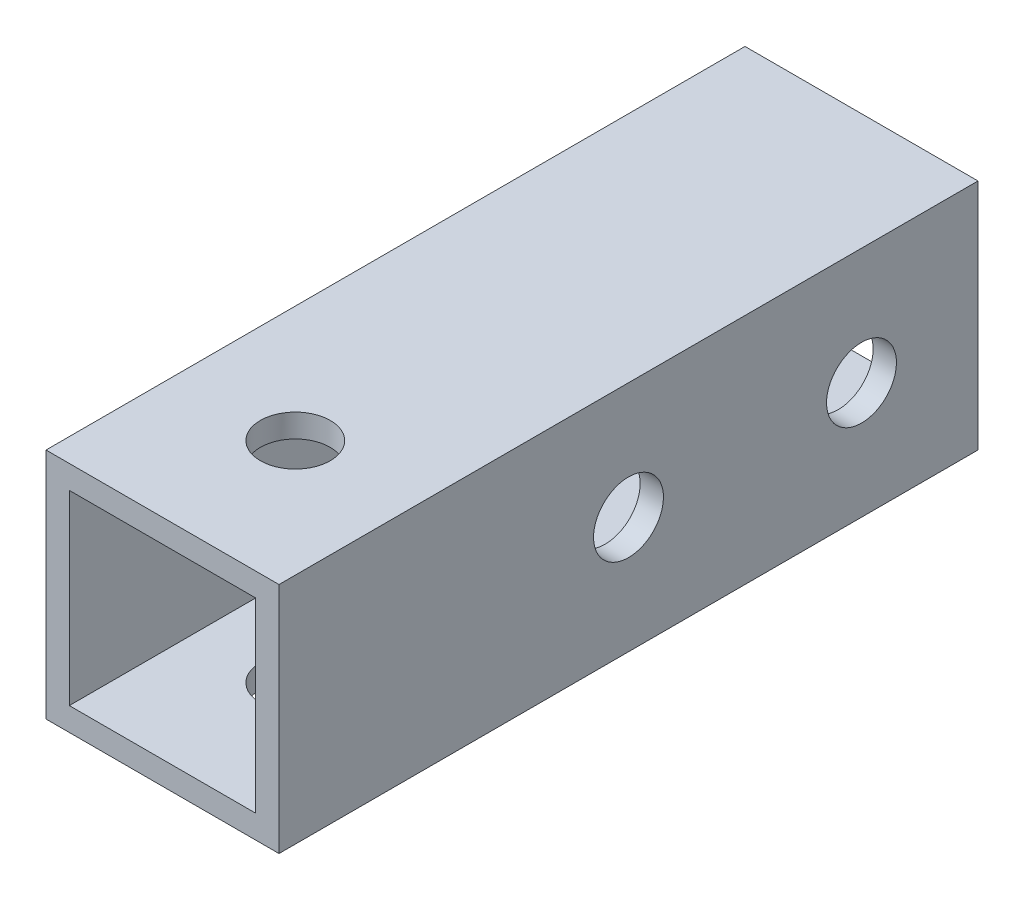
ISO-10303-21;
HEADER;
FILE_DESCRIPTION(('STEP AP214'),'2;1');
FILE_NAME('part.step','',(''),(''),'','','');
FILE_SCHEMA(('AUTOMOTIVE_DESIGN { 1 0 10303 214 1 1 1 1 }'));
ENDSEC;
DATA;
#1=APPLICATION_CONTEXT('core data for automotive mechanical design processes');
#2=APPLICATION_PROTOCOL_DEFINITION('international standard','automotive_design',2000,#1);
#3=PRODUCT_CONTEXT('',#1,'mechanical');
#4=PRODUCT('Part','Part','',(#3));
#5=PRODUCT_RELATED_PRODUCT_CATEGORY('part','',(#4));
#6=PRODUCT_DEFINITION_FORMATION('','',#4);
#7=PRODUCT_DEFINITION_CONTEXT('part definition',#1,'design');
#8=PRODUCT_DEFINITION('design','',#6,#7);
#9=PRODUCT_DEFINITION_SHAPE('','',#8);
#10=(LENGTH_UNIT() NAMED_UNIT(*) SI_UNIT(.MILLI.,.METRE.));
#11=(NAMED_UNIT(*) PLANE_ANGLE_UNIT() SI_UNIT($,.RADIAN.));
#12=(NAMED_UNIT(*) SI_UNIT($,.STERADIAN.) SOLID_ANGLE_UNIT());
#13=UNCERTAINTY_MEASURE_WITH_UNIT(LENGTH_MEASURE(1.E-05),#10,'distance_accuracy_value','');
#14=(GEOMETRIC_REPRESENTATION_CONTEXT(3) GLOBAL_UNCERTAINTY_ASSIGNED_CONTEXT((#13)) GLOBAL_UNIT_ASSIGNED_CONTEXT((#10,
#11,#12)) REPRESENTATION_CONTEXT('',''));
#15=CARTESIAN_POINT('',(0.,0.,0.));
#16=DIRECTION('',(0.,0.,1.));
#17=DIRECTION('',(1.,0.,0.));
#18=AXIS2_PLACEMENT_3D('',#15,#16,#17);
#19=CARTESIAN_POINT('',(0.,0.,30.));
#20=DIRECTION('',(0.,0.,1.));
#21=DIRECTION('',(1.,0.,0.));
#22=AXIS2_PLACEMENT_3D('',#19,#20,#21);
#23=PLANE('',#22);
#24=DIRECTION('',(0.,-1.,0.));
#25=VECTOR('',#24,1.);
#26=CARTESIAN_POINT('',(-5.,5.,30.));
#27=LINE('',#26,#25);
#28=CARTESIAN_POINT('',(-5.,5.,30.));
#29=VERTEX_POINT('',#28);
#30=CARTESIAN_POINT('',(-5.,-5.,30.));
#31=VERTEX_POINT('',#30);
#32=EDGE_CURVE('E167',#29,#31,#27,.T.);
#33=ORIENTED_EDGE('',*,*,#32,.T.);
#34=DIRECTION('',(1.,0.,0.));
#35=VECTOR('',#34,1.);
#36=CARTESIAN_POINT('',(-5.,-5.,30.));
#37=LINE('',#36,#35);
#38=CARTESIAN_POINT('',(5.,-5.,30.));
#39=VERTEX_POINT('',#38);
#40=EDGE_CURVE('E170',#31,#39,#37,.T.);
#41=ORIENTED_EDGE('',*,*,#40,.T.);
#42=DIRECTION('',(0.,1.,0.));
#43=VECTOR('',#42,1.);
#44=CARTESIAN_POINT('',(5.,5.,30.));
#45=LINE('',#44,#43);
#46=CARTESIAN_POINT('',(5.,5.,30.));
#47=VERTEX_POINT('',#46);
#48=EDGE_CURVE('E173',#39,#47,#45,.T.);
#49=ORIENTED_EDGE('',*,*,#48,.T.);
#50=DIRECTION('',(-1.,0.,0.));
#51=VECTOR('',#50,1.);
#52=CARTESIAN_POINT('',(-5.,5.,30.));
#53=LINE('',#52,#51);
#54=EDGE_CURVE('E175',#47,#29,#53,.T.);
#55=ORIENTED_EDGE('',*,*,#54,.T.);
#56=EDGE_LOOP('',(#33,#41,#49,#55));
#57=FACE_BOUND('',#56,.T.);
#58=DIRECTION('',(1.,0.,0.));
#59=VECTOR('',#58,1.);
#60=CARTESIAN_POINT('',(-5.,-4.,30.));
#61=LINE('',#60,#59);
#62=CARTESIAN_POINT('',(-4.,-4.,30.));
#63=VERTEX_POINT('',#62);
#64=CARTESIAN_POINT('',(4.,-4.,30.));
#65=VERTEX_POINT('',#64);
#66=EDGE_CURVE('E137',#63,#65,#61,.T.);
#67=ORIENTED_EDGE('',*,*,#66,.F.);
#68=DIRECTION('',(0.,-1.,0.));
#69=VECTOR('',#68,1.);
#70=CARTESIAN_POINT('',(-4.,5.,30.));
#71=LINE('',#70,#69);
#72=CARTESIAN_POINT('',(-4.,4.,30.));
#73=VERTEX_POINT('',#72);
#74=EDGE_CURVE('E129',#73,#63,#71,.T.);
#75=ORIENTED_EDGE('',*,*,#74,.F.);
#76=DIRECTION('',(-1.,0.,0.));
#77=VECTOR('',#76,1.);
#78=CARTESIAN_POINT('',(-5.,4.,30.));
#79=LINE('',#78,#77);
#80=CARTESIAN_POINT('',(4.,4.,30.));
#81=VERTEX_POINT('',#80);
#82=EDGE_CURVE('E151',#81,#73,#79,.T.);
#83=ORIENTED_EDGE('',*,*,#82,.F.);
#84=DIRECTION('',(0.,1.,0.));
#85=VECTOR('',#84,1.);
#86=CARTESIAN_POINT('',(4.,5.,30.));
#87=LINE('',#86,#85);
#88=EDGE_CURVE('E149',#65,#81,#87,.T.);
#89=ORIENTED_EDGE('',*,*,#88,.F.);
#90=EDGE_LOOP('',(#67,#75,#83,#89));
#91=FACE_BOUND('',#90,.T.);
#92=ADVANCED_FACE('F62',(#57,#91),#23,.T.);
#93=CARTESIAN_POINT('',(0.,0.,0.));
#94=DIRECTION('',(0.,0.,1.));
#95=DIRECTION('',(1.,0.,0.));
#96=AXIS2_PLACEMENT_3D('',#93,#94,#95);
#97=PLANE('',#96);
#98=DIRECTION('',(0.,-1.,0.));
#99=VECTOR('',#98,1.);
#100=CARTESIAN_POINT('',(-5.,5.,0.));
#101=LINE('',#100,#99);
#102=CARTESIAN_POINT('',(-5.,5.,0.));
#103=VERTEX_POINT('',#102);
#104=CARTESIAN_POINT('',(-5.,-5.,0.));
#105=VERTEX_POINT('',#104);
#106=EDGE_CURVE('E145',#103,#105,#101,.T.);
#107=ORIENTED_EDGE('',*,*,#106,.F.);
#108=DIRECTION('',(-1.,0.,0.));
#109=VECTOR('',#108,1.);
#110=CARTESIAN_POINT('',(-5.,5.,0.));
#111=LINE('',#110,#109);
#112=CARTESIAN_POINT('',(5.,5.,0.));
#113=VERTEX_POINT('',#112);
#114=EDGE_CURVE('E171',#113,#103,#111,.T.);
#115=ORIENTED_EDGE('',*,*,#114,.F.);
#116=DIRECTION('',(0.,1.,0.));
#117=VECTOR('',#116,1.);
#118=CARTESIAN_POINT('',(5.,5.,0.));
#119=LINE('',#118,#117);
#120=CARTESIAN_POINT('',(5.,-5.,0.));
#121=VERTEX_POINT('',#120);
#122=EDGE_CURVE('E182',#121,#113,#119,.T.);
#123=ORIENTED_EDGE('',*,*,#122,.F.);
#124=DIRECTION('',(1.,0.,0.));
#125=VECTOR('',#124,1.);
#126=CARTESIAN_POINT('',(-5.,-5.,0.));
#127=LINE('',#126,#125);
#128=EDGE_CURVE('E180',#105,#121,#127,.T.);
#129=ORIENTED_EDGE('',*,*,#128,.F.);
#130=EDGE_LOOP('',(#107,#115,#123,#129));
#131=FACE_BOUND('',#130,.T.);
#132=DIRECTION('',(0.,-1.,0.));
#133=VECTOR('',#132,1.);
#134=CARTESIAN_POINT('',(-4.,5.,0.));
#135=LINE('',#134,#133);
#136=CARTESIAN_POINT('',(-4.,4.,0.));
#137=VERTEX_POINT('',#136);
#138=CARTESIAN_POINT('',(-4.,-4.,0.));
#139=VERTEX_POINT('',#138);
#140=EDGE_CURVE('E87',#137,#139,#135,.T.);
#141=ORIENTED_EDGE('',*,*,#140,.T.);
#142=DIRECTION('',(1.,0.,0.));
#143=VECTOR('',#142,1.);
#144=CARTESIAN_POINT('',(-5.,-4.,0.));
#145=LINE('',#144,#143);
#146=CARTESIAN_POINT('',(4.,-4.,0.));
#147=VERTEX_POINT('',#146);
#148=EDGE_CURVE('E144',#139,#147,#145,.T.);
#149=ORIENTED_EDGE('',*,*,#148,.T.);
#150=DIRECTION('',(0.,1.,0.));
#151=VECTOR('',#150,1.);
#152=CARTESIAN_POINT('',(4.,5.,0.));
#153=LINE('',#152,#151);
#154=CARTESIAN_POINT('',(4.,4.,0.));
#155=VERTEX_POINT('',#154);
#156=EDGE_CURVE('E159',#147,#155,#153,.T.);
#157=ORIENTED_EDGE('',*,*,#156,.T.);
#158=DIRECTION('',(-1.,0.,0.));
#159=VECTOR('',#158,1.);
#160=CARTESIAN_POINT('',(-5.,4.,0.));
#161=LINE('',#160,#159);
#162=EDGE_CURVE('E138',#155,#137,#161,.T.);
#163=ORIENTED_EDGE('',*,*,#162,.T.);
#164=EDGE_LOOP('',(#141,#149,#157,#163));
#165=FACE_BOUND('',#164,.T.);
#166=ADVANCED_FACE('F240',(#131,#165),#97,.F.);
#167=CARTESIAN_POINT('',(-5.,5.,30.));
#168=DIRECTION('',(1.,0.,0.));
#169=DIRECTION('',(0.,1.,0.));
#170=AXIS2_PLACEMENT_3D('',#167,#168,#169);
#171=PLANE('',#170);
#172=CARTESIAN_POINT('',(-5.00000000000001,0.,5.));
#173=DIRECTION('',(1.,0.,0.));
#174=DIRECTION('',(0.,1.,0.));
#175=AXIS2_PLACEMENT_3D('',#172,#173,#174);
#176=CIRCLE('',#175,1.5);
#177=CARTESIAN_POINT('',(-5.00000000000001,1.49999999999999,5.));
#178=VERTEX_POINT('',#177);
#179=EDGE_CURVE('E195',#178,#178,#176,.T.);
#180=ORIENTED_EDGE('',*,*,#179,.T.);
#181=EDGE_LOOP('',(#180));
#182=FACE_BOUND('',#181,.T.);
#183=CARTESIAN_POINT('',(-5.00000000000001,0.,15.));
#184=DIRECTION('',(1.,0.,0.));
#185=DIRECTION('',(0.,1.,0.));
#186=AXIS2_PLACEMENT_3D('',#183,#184,#185);
#187=CIRCLE('',#186,1.5);
#188=CARTESIAN_POINT('',(-5.00000000000001,1.49999999999999,15.));
#189=VERTEX_POINT('',#188);
#190=EDGE_CURVE('E209',#189,#189,#187,.T.);
#191=ORIENTED_EDGE('',*,*,#190,.T.);
#192=EDGE_LOOP('',(#191));
#193=FACE_BOUND('',#192,.T.);
#194=ORIENTED_EDGE('',*,*,#106,.T.);
#195=DIRECTION('',(0.,0.,-1.));
#196=VECTOR('',#195,1.);
#197=CARTESIAN_POINT('',(-5.,-5.,30.));
#198=LINE('',#197,#196);
#199=EDGE_CURVE('E12',#31,#105,#198,.T.);
#200=ORIENTED_EDGE('',*,*,#199,.F.);
#201=ORIENTED_EDGE('',*,*,#32,.F.);
#202=DIRECTION('',(0.,0.,-1.));
#203=VECTOR('',#202,1.);
#204=CARTESIAN_POINT('',(-5.,5.,30.));
#205=LINE('',#204,#203);
#206=EDGE_CURVE('E177',#29,#103,#205,.T.);
#207=ORIENTED_EDGE('',*,*,#206,.T.);
#208=EDGE_LOOP('',(#194,#200,#201,#207));
#209=FACE_BOUND('',#208,.T.);
#210=ADVANCED_FACE('F64',(#182,#193,#209),#171,.F.);
#211=CARTESIAN_POINT('',(-5.,-5.,30.));
#212=DIRECTION('',(0.,1.,0.));
#213=DIRECTION('',(0.,0.,1.));
#214=AXIS2_PLACEMENT_3D('',#211,#212,#213);
#215=PLANE('',#214);
#216=CARTESIAN_POINT('',(0.,-5.,24.3));
#217=DIRECTION('',(0.,1.,0.));
#218=DIRECTION('',(0.,0.,1.));
#219=AXIS2_PLACEMENT_3D('',#216,#217,#218);
#220=CIRCLE('',#219,1.5);
#221=CARTESIAN_POINT('',(0.,-5.,25.8));
#222=VERTEX_POINT('',#221);
#223=EDGE_CURVE('E223',#222,#222,#220,.T.);
#224=ORIENTED_EDGE('',*,*,#223,.T.);
#225=EDGE_LOOP('',(#224));
#226=FACE_BOUND('',#225,.T.);
#227=ORIENTED_EDGE('',*,*,#128,.T.);
#228=DIRECTION('',(0.,0.,-1.));
#229=VECTOR('',#228,1.);
#230=CARTESIAN_POINT('',(5.,-5.,30.));
#231=LINE('',#230,#229);
#232=EDGE_CURVE('E71',#39,#121,#231,.T.);
#233=ORIENTED_EDGE('',*,*,#232,.F.);
#234=ORIENTED_EDGE('',*,*,#40,.F.);
#235=ORIENTED_EDGE('',*,*,#199,.T.);
#236=EDGE_LOOP('',(#227,#233,#234,#235));
#237=FACE_BOUND('',#236,.T.);
#238=ADVANCED_FACE('F267',(#226,#237),#215,.F.);
#239=CARTESIAN_POINT('',(5.,5.,30.));
#240=DIRECTION('',(-1.,0.,0.));
#241=DIRECTION('',(0.,-1.,0.));
#242=AXIS2_PLACEMENT_3D('',#239,#240,#241);
#243=PLANE('',#242);
#244=CARTESIAN_POINT('',(5.,0.,5.));
#245=DIRECTION('',(1.,0.,0.));
#246=DIRECTION('',(0.,1.,0.));
#247=AXIS2_PLACEMENT_3D('',#244,#245,#246);
#248=CIRCLE('',#247,1.5);
#249=CARTESIAN_POINT('',(5.,1.5,5.));
#250=VERTEX_POINT('',#249);
#251=EDGE_CURVE('E213',#250,#250,#248,.T.);
#252=ORIENTED_EDGE('',*,*,#251,.F.);
#253=EDGE_LOOP('',(#252));
#254=FACE_BOUND('',#253,.T.);
#255=CARTESIAN_POINT('',(5.,0.,15.));
#256=DIRECTION('',(1.,0.,0.));
#257=DIRECTION('',(0.,1.,0.));
#258=AXIS2_PLACEMENT_3D('',#255,#256,#257);
#259=CIRCLE('',#258,1.5);
#260=CARTESIAN_POINT('',(5.,1.5,15.));
#261=VERTEX_POINT('',#260);
#262=EDGE_CURVE('E206',#261,#261,#259,.T.);
#263=ORIENTED_EDGE('',*,*,#262,.F.);
#264=EDGE_LOOP('',(#263));
#265=FACE_BOUND('',#264,.T.);
#266=ORIENTED_EDGE('',*,*,#122,.T.);
#267=DIRECTION('',(0.,0.,-1.));
#268=VECTOR('',#267,1.);
#269=CARTESIAN_POINT('',(5.,5.,30.));
#270=LINE('',#269,#268);
#271=EDGE_CURVE('E187',#47,#113,#270,.T.);
#272=ORIENTED_EDGE('',*,*,#271,.F.);
#273=ORIENTED_EDGE('',*,*,#48,.F.);
#274=ORIENTED_EDGE('',*,*,#232,.T.);
#275=EDGE_LOOP('',(#266,#272,#273,#274));
#276=FACE_BOUND('',#275,.T.);
#277=ADVANCED_FACE('F264',(#254,#265,#276),#243,.F.);
#278=CARTESIAN_POINT('',(-5.,5.,30.));
#279=DIRECTION('',(0.,-1.,0.));
#280=DIRECTION('',(0.,0.,-1.));
#281=AXIS2_PLACEMENT_3D('',#278,#279,#280);
#282=PLANE('',#281);
#283=CARTESIAN_POINT('',(0.,5.,24.3));
#284=DIRECTION('',(0.,1.,0.));
#285=DIRECTION('',(0.,0.,1.));
#286=AXIS2_PLACEMENT_3D('',#283,#284,#285);
#287=CIRCLE('',#286,1.5);
#288=CARTESIAN_POINT('',(0.,5.,25.8));
#289=VERTEX_POINT('',#288);
#290=EDGE_CURVE('E220',#289,#289,#287,.T.);
#291=ORIENTED_EDGE('',*,*,#290,.F.);
#292=EDGE_LOOP('',(#291));
#293=FACE_BOUND('',#292,.T.);
#294=ORIENTED_EDGE('',*,*,#114,.T.);
#295=ORIENTED_EDGE('',*,*,#206,.F.);
#296=ORIENTED_EDGE('',*,*,#54,.F.);
#297=ORIENTED_EDGE('',*,*,#271,.T.);
#298=EDGE_LOOP('',(#294,#295,#296,#297));
#299=FACE_BOUND('',#298,.T.);
#300=ADVANCED_FACE('F261',(#293,#299),#282,.F.);
#301=CARTESIAN_POINT('',(-4.,5.,30.));
#302=DIRECTION('',(1.,0.,0.));
#303=DIRECTION('',(0.,1.,0.));
#304=AXIS2_PLACEMENT_3D('',#301,#302,#303);
#305=PLANE('',#304);
#306=CARTESIAN_POINT('',(-4.,0.,5.));
#307=DIRECTION('',(1.,0.,0.));
#308=DIRECTION('',(0.,1.,0.));
#309=AXIS2_PLACEMENT_3D('',#306,#307,#308);
#310=CIRCLE('',#309,1.5);
#311=CARTESIAN_POINT('',(-4.,1.49999999999999,5.));
#312=VERTEX_POINT('',#311);
#313=EDGE_CURVE('E157',#312,#312,#310,.T.);
#314=ORIENTED_EDGE('',*,*,#313,.F.);
#315=EDGE_LOOP('',(#314));
#316=FACE_BOUND('',#315,.T.);
#317=CARTESIAN_POINT('',(-4.,0.,15.));
#318=DIRECTION('',(1.,0.,0.));
#319=DIRECTION('',(0.,1.,0.));
#320=AXIS2_PLACEMENT_3D('',#317,#318,#319);
#321=CIRCLE('',#320,1.5);
#322=CARTESIAN_POINT('',(-4.,1.5,15.));
#323=VERTEX_POINT('',#322);
#324=EDGE_CURVE('E194',#323,#323,#321,.T.);
#325=ORIENTED_EDGE('',*,*,#324,.F.);
#326=EDGE_LOOP('',(#325));
#327=FACE_BOUND('',#326,.T.);
#328=ORIENTED_EDGE('',*,*,#140,.F.);
#329=DIRECTION('',(0.,0.,-1.));
#330=VECTOR('',#329,1.);
#331=CARTESIAN_POINT('',(-4.,4.,30.));
#332=LINE('',#331,#330);
#333=EDGE_CURVE('E133',#73,#137,#332,.T.);
#334=ORIENTED_EDGE('',*,*,#333,.F.);
#335=ORIENTED_EDGE('',*,*,#74,.T.);
#336=DIRECTION('',(0.,0.,-1.));
#337=VECTOR('',#336,1.);
#338=CARTESIAN_POINT('',(-4.,-4.,30.));
#339=LINE('',#338,#337);
#340=EDGE_CURVE('E132',#63,#139,#339,.T.);
#341=ORIENTED_EDGE('',*,*,#340,.T.);
#342=EDGE_LOOP('',(#328,#334,#335,#341));
#343=FACE_BOUND('',#342,.T.);
#344=ADVANCED_FACE('F131',(#316,#327,#343),#305,.T.);
#345=CARTESIAN_POINT('',(-5.,-4.,30.));
#346=DIRECTION('',(0.,1.,0.));
#347=DIRECTION('',(0.,0.,1.));
#348=AXIS2_PLACEMENT_3D('',#345,#346,#347);
#349=PLANE('',#348);
#350=CARTESIAN_POINT('',(0.,-4.,24.3));
#351=DIRECTION('',(0.,1.,0.));
#352=DIRECTION('',(0.,0.,1.));
#353=AXIS2_PLACEMENT_3D('',#350,#351,#352);
#354=CIRCLE('',#353,1.5);
#355=CARTESIAN_POINT('',(0.,-4.,25.8));
#356=VERTEX_POINT('',#355);
#357=EDGE_CURVE('E210',#356,#356,#354,.T.);
#358=ORIENTED_EDGE('',*,*,#357,.F.);
#359=EDGE_LOOP('',(#358));
#360=FACE_BOUND('',#359,.T.);
#361=ORIENTED_EDGE('',*,*,#148,.F.);
#362=ORIENTED_EDGE('',*,*,#340,.F.);
#363=ORIENTED_EDGE('',*,*,#66,.T.);
#364=DIRECTION('',(0.,0.,-1.));
#365=VECTOR('',#364,1.);
#366=CARTESIAN_POINT('',(4.,-4.,30.));
#367=LINE('',#366,#365);
#368=EDGE_CURVE('E146',#65,#147,#367,.T.);
#369=ORIENTED_EDGE('',*,*,#368,.T.);
#370=EDGE_LOOP('',(#361,#362,#363,#369));
#371=FACE_BOUND('',#370,.T.);
#372=ADVANCED_FACE('F141',(#360,#371),#349,.T.);
#373=CARTESIAN_POINT('',(4.,5.,30.));
#374=DIRECTION('',(-1.,0.,0.));
#375=DIRECTION('',(0.,-1.,0.));
#376=AXIS2_PLACEMENT_3D('',#373,#374,#375);
#377=PLANE('',#376);
#378=CARTESIAN_POINT('',(4.,0.,5.));
#379=DIRECTION('',(-1.,0.,0.));
#380=DIRECTION('',(0.,-1.,0.));
#381=AXIS2_PLACEMENT_3D('',#378,#379,#380);
#382=CIRCLE('',#381,1.5);
#383=CARTESIAN_POINT('',(4.,-1.5,5.));
#384=VERTEX_POINT('',#383);
#385=EDGE_CURVE('E196',#384,#384,#382,.T.);
#386=ORIENTED_EDGE('',*,*,#385,.F.);
#387=EDGE_LOOP('',(#386));
#388=FACE_BOUND('',#387,.T.);
#389=CARTESIAN_POINT('',(4.,0.,15.));
#390=DIRECTION('',(-1.,0.,0.));
#391=DIRECTION('',(0.,-1.,0.));
#392=AXIS2_PLACEMENT_3D('',#389,#390,#391);
#393=CIRCLE('',#392,1.5);
#394=CARTESIAN_POINT('',(4.,-1.5,15.));
#395=VERTEX_POINT('',#394);
#396=EDGE_CURVE('E192',#395,#395,#393,.T.);
#397=ORIENTED_EDGE('',*,*,#396,.F.);
#398=EDGE_LOOP('',(#397));
#399=FACE_BOUND('',#398,.T.);
#400=ORIENTED_EDGE('',*,*,#156,.F.);
#401=ORIENTED_EDGE('',*,*,#368,.F.);
#402=ORIENTED_EDGE('',*,*,#88,.T.);
#403=DIRECTION('',(0.,0.,-1.));
#404=VECTOR('',#403,1.);
#405=CARTESIAN_POINT('',(4.,4.,30.));
#406=LINE('',#405,#404);
#407=EDGE_CURVE('E79',#81,#155,#406,.T.);
#408=ORIENTED_EDGE('',*,*,#407,.T.);
#409=EDGE_LOOP('',(#400,#401,#402,#408));
#410=FACE_BOUND('',#409,.T.);
#411=ADVANCED_FACE('F236',(#388,#399,#410),#377,.T.);
#412=CARTESIAN_POINT('',(-5.,4.,30.));
#413=DIRECTION('',(0.,-1.,0.));
#414=DIRECTION('',(0.,0.,-1.));
#415=AXIS2_PLACEMENT_3D('',#412,#413,#414);
#416=PLANE('',#415);
#417=CARTESIAN_POINT('',(0.,4.,24.3));
#418=DIRECTION('',(0.,-1.,0.));
#419=DIRECTION('',(0.,0.,-1.));
#420=AXIS2_PLACEMENT_3D('',#417,#418,#419);
#421=CIRCLE('',#420,1.5);
#422=CARTESIAN_POINT('',(0.,4.,22.8));
#423=VERTEX_POINT('',#422);
#424=EDGE_CURVE('E66',#423,#423,#421,.T.);
#425=ORIENTED_EDGE('',*,*,#424,.F.);
#426=EDGE_LOOP('',(#425));
#427=FACE_BOUND('',#426,.T.);
#428=ORIENTED_EDGE('',*,*,#162,.F.);
#429=ORIENTED_EDGE('',*,*,#407,.F.);
#430=ORIENTED_EDGE('',*,*,#82,.T.);
#431=ORIENTED_EDGE('',*,*,#333,.T.);
#432=EDGE_LOOP('',(#428,#429,#430,#431));
#433=FACE_BOUND('',#432,.T.);
#434=ADVANCED_FACE('F233',(#427,#433),#416,.T.);
#435=CARTESIAN_POINT('',(-5.00000000000001,0.,15.));
#436=DIRECTION('',(1.,0.,0.));
#437=DIRECTION('',(0.,1.,0.));
#438=AXIS2_PLACEMENT_3D('',#435,#436,#437);
#439=CYLINDRICAL_SURFACE('',#438,1.5);
#440=ORIENTED_EDGE('',*,*,#396,.T.);
#441=EDGE_LOOP('',(#440));
#442=FACE_BOUND('',#441,.T.);
#443=ORIENTED_EDGE('',*,*,#262,.T.);
#444=EDGE_LOOP('',(#443));
#445=FACE_BOUND('',#444,.T.);
#446=ADVANCED_FACE('F235',(#442,#445),#439,.F.);
#447=CARTESIAN_POINT('',(-5.00000000000001,0.,5.));
#448=DIRECTION('',(1.,0.,0.));
#449=DIRECTION('',(0.,1.,0.));
#450=AXIS2_PLACEMENT_3D('',#447,#448,#449);
#451=CYLINDRICAL_SURFACE('',#450,1.5);
#452=ORIENTED_EDGE('',*,*,#385,.T.);
#453=EDGE_LOOP('',(#452));
#454=FACE_BOUND('',#453,.T.);
#455=ORIENTED_EDGE('',*,*,#251,.T.);
#456=EDGE_LOOP('',(#455));
#457=FACE_BOUND('',#456,.T.);
#458=ADVANCED_FACE('F297',(#454,#457),#451,.F.);
#459=ORIENTED_EDGE('',*,*,#324,.T.);
#460=EDGE_LOOP('',(#459));
#461=FACE_BOUND('',#460,.T.);
#462=ORIENTED_EDGE('',*,*,#190,.F.);
#463=EDGE_LOOP('',(#462));
#464=FACE_BOUND('',#463,.T.);
#465=ADVANCED_FACE('F294',(#461,#464),#439,.F.);
#466=ORIENTED_EDGE('',*,*,#313,.T.);
#467=EDGE_LOOP('',(#466));
#468=FACE_BOUND('',#467,.T.);
#469=ORIENTED_EDGE('',*,*,#179,.F.);
#470=EDGE_LOOP('',(#469));
#471=FACE_BOUND('',#470,.T.);
#472=ADVANCED_FACE('F296',(#468,#471),#451,.F.);
#473=CARTESIAN_POINT('',(0.,-5.,24.3));
#474=DIRECTION('',(0.,1.,0.));
#475=DIRECTION('',(0.,0.,1.));
#476=AXIS2_PLACEMENT_3D('',#473,#474,#475);
#477=CYLINDRICAL_SURFACE('',#476,1.5);
#478=ORIENTED_EDGE('',*,*,#424,.T.);
#479=EDGE_LOOP('',(#478));
#480=FACE_BOUND('',#479,.T.);
#481=ORIENTED_EDGE('',*,*,#290,.T.);
#482=EDGE_LOOP('',(#481));
#483=FACE_BOUND('',#482,.T.);
#484=ADVANCED_FACE('F230',(#480,#483),#477,.F.);
#485=ORIENTED_EDGE('',*,*,#357,.T.);
#486=EDGE_LOOP('',(#485));
#487=FACE_BOUND('',#486,.T.);
#488=ORIENTED_EDGE('',*,*,#223,.F.);
#489=EDGE_LOOP('',(#488));
#490=FACE_BOUND('',#489,.T.);
#491=ADVANCED_FACE('F370',(#487,#490),#477,.F.);
#492=CLOSED_SHELL('',(#92,#166,#210,#238,#277,#300,#344,#372,#411,#434,#446,#458,#465,#472,#484,#491));
#493=MANIFOLD_SOLID_BREP('B2',#492);
#494=ADVANCED_BREP_SHAPE_REPRESENTATION('',(#18,#493),#14);
#495=SHAPE_DEFINITION_REPRESENTATION(#9,#494);
ENDSEC;
END-ISO-10303-21;
